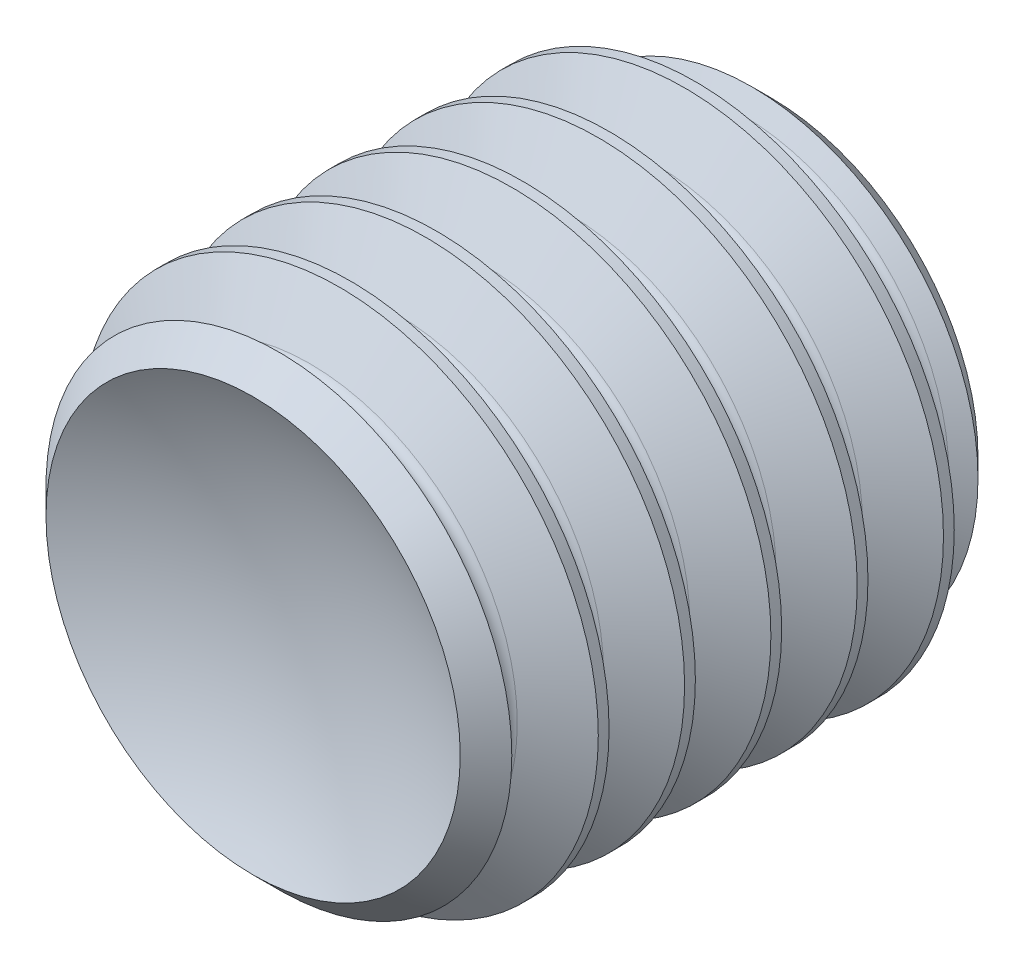
ISO-10303-21;
HEADER;
FILE_DESCRIPTION(('STEP AP214'),'2;1');
FILE_NAME('part.step','',(''),(''),'','','');
FILE_SCHEMA(('AUTOMOTIVE_DESIGN { 1 0 10303 214 1 1 1 1 }'));
ENDSEC;
DATA;
#1=APPLICATION_CONTEXT('core data for automotive mechanical design processes');
#2=APPLICATION_PROTOCOL_DEFINITION('international standard','automotive_design',2000,#1);
#3=PRODUCT_CONTEXT('',#1,'mechanical');
#4=PRODUCT('Part','Part','',(#3));
#5=PRODUCT_RELATED_PRODUCT_CATEGORY('part','',(#4));
#6=PRODUCT_DEFINITION_FORMATION('','',#4);
#7=PRODUCT_DEFINITION_CONTEXT('part definition',#1,'design');
#8=PRODUCT_DEFINITION('design','',#6,#7);
#9=PRODUCT_DEFINITION_SHAPE('','',#8);
#10=(LENGTH_UNIT() NAMED_UNIT(*) SI_UNIT(.MILLI.,.METRE.));
#11=(NAMED_UNIT(*) PLANE_ANGLE_UNIT() SI_UNIT($,.RADIAN.));
#12=(NAMED_UNIT(*) SI_UNIT($,.STERADIAN.) SOLID_ANGLE_UNIT());
#13=UNCERTAINTY_MEASURE_WITH_UNIT(LENGTH_MEASURE(1.E-05),#10,'distance_accuracy_value','');
#14=(GEOMETRIC_REPRESENTATION_CONTEXT(3) GLOBAL_UNCERTAINTY_ASSIGNED_CONTEXT((#13)) GLOBAL_UNIT_ASSIGNED_CONTEXT((#10,
#11,#12)) REPRESENTATION_CONTEXT('',''));
#15=CARTESIAN_POINT('',(0.,0.,0.));
#16=DIRECTION('',(0.,0.,1.));
#17=DIRECTION('',(1.,0.,0.));
#18=AXIS2_PLACEMENT_3D('',#15,#16,#17);
#19=CARTESIAN_POINT('',(0.,1.5,0.));
#20=DIRECTION('',(0.,0.,1.));
#21=DIRECTION('',(0.,-1.,0.));
#22=AXIS2_PLACEMENT_3D('',#19,#20,#21);
#23=PLANE('',#22);
#24=CARTESIAN_POINT('',(0.,0.,0.));
#25=DIRECTION('',(0.,0.,1.));
#26=DIRECTION('',(1.,0.,0.));
#27=AXIS2_PLACEMENT_3D('',#24,#25,#26);
#28=CIRCLE('',#27,1.2);
#29=CARTESIAN_POINT('',(1.2,0.,0.));
#30=VERTEX_POINT('',#29);
#31=EDGE_CURVE('E11',#30,#30,#28,.T.);
#32=ORIENTED_EDGE('',*,*,#31,.F.);
#33=EDGE_LOOP('',(#32));
#34=FACE_BOUND('',#33,.T.);
#35=DIRECTION('',(-0.5,0.866025403784439,0.));
#36=VECTOR('',#35,1.);
#37=CARTESIAN_POINT('',(0.866025403784439,0.,0.));
#38=LINE('',#37,#36);
#39=CARTESIAN_POINT('',(0.866025403784439,0.,0.));
#40=VERTEX_POINT('',#39);
#41=CARTESIAN_POINT('',(0.433012701892219,0.75,0.));
#42=VERTEX_POINT('',#41);
#43=EDGE_CURVE('E51',#40,#42,#38,.T.);
#44=ORIENTED_EDGE('',*,*,#43,.T.);
#45=DIRECTION('',(-1.,0.,0.));
#46=VECTOR('',#45,1.);
#47=CARTESIAN_POINT('',(0.433012701892219,0.75,0.));
#48=LINE('',#47,#46);
#49=CARTESIAN_POINT('',(-0.433012701892219,0.75,0.));
#50=VERTEX_POINT('',#49);
#51=EDGE_CURVE('E128',#42,#50,#48,.T.);
#52=ORIENTED_EDGE('',*,*,#51,.T.);
#53=DIRECTION('',(-0.5,-0.866025403784439,0.));
#54=VECTOR('',#53,1.);
#55=CARTESIAN_POINT('',(-0.433012701892219,0.75,0.));
#56=LINE('',#55,#54);
#57=CARTESIAN_POINT('',(-0.866025403784439,0.,0.));
#58=VERTEX_POINT('',#57);
#59=EDGE_CURVE('E131',#50,#58,#56,.T.);
#60=ORIENTED_EDGE('',*,*,#59,.T.);
#61=DIRECTION('',(0.5,-0.866025403784439,0.));
#62=VECTOR('',#61,1.);
#63=CARTESIAN_POINT('',(-0.866025403784439,0.,0.));
#64=LINE('',#63,#62);
#65=CARTESIAN_POINT('',(-0.433012701892219,-0.75,0.));
#66=VERTEX_POINT('',#65);
#67=EDGE_CURVE('E134',#58,#66,#64,.T.);
#68=ORIENTED_EDGE('',*,*,#67,.T.);
#69=DIRECTION('',(1.,0.,0.));
#70=VECTOR('',#69,1.);
#71=CARTESIAN_POINT('',(-0.433012701892219,-0.75,0.));
#72=LINE('',#71,#70);
#73=CARTESIAN_POINT('',(0.43301270189222,-0.75,0.));
#74=VERTEX_POINT('',#73);
#75=EDGE_CURVE('E98',#66,#74,#72,.T.);
#76=ORIENTED_EDGE('',*,*,#75,.T.);
#77=DIRECTION('',(0.5,0.866025403784439,0.));
#78=VECTOR('',#77,1.);
#79=CARTESIAN_POINT('',(0.43301270189222,-0.75,0.));
#80=LINE('',#79,#78);
#81=EDGE_CURVE('E93',#74,#40,#80,.T.);
#82=ORIENTED_EDGE('',*,*,#81,.T.);
#83=EDGE_LOOP('',(#44,#52,#60,#68,#76,#82));
#84=FACE_BOUND('',#83,.T.);
#85=ADVANCED_FACE('F34',(#34,#84),#23,.F.);
#86=CARTESIAN_POINT('',(0.,0.,3.));
#87=DIRECTION('',(0.,0.,1.));
#88=DIRECTION('',(0.,-1.,0.));
#89=AXIS2_PLACEMENT_3D('',#86,#87,#88);
#90=CYLINDRICAL_SURFACE('',#89,1.5);
#91=CARTESIAN_POINT('',(0.,0.,0.5));
#92=DIRECTION('',(0.,0.,1.));
#93=DIRECTION('',(1.,0.,0.));
#94=AXIS2_PLACEMENT_3D('',#91,#92,#93);
#95=CIRCLE('',#94,1.5);
#96=CARTESIAN_POINT('',(1.5,0.,0.5));
#97=VERTEX_POINT('',#96);
#98=EDGE_CURVE('E185',#97,#97,#95,.T.);
#99=ORIENTED_EDGE('',*,*,#98,.F.);
#100=EDGE_LOOP('',(#99));
#101=FACE_BOUND('',#100,.T.);
#102=CARTESIAN_POINT('',(0.,0.,0.437499999999999));
#103=DIRECTION('',(0.,0.,1.));
#104=DIRECTION('',(1.,0.,0.));
#105=AXIS2_PLACEMENT_3D('',#102,#103,#104);
#106=CIRCLE('',#105,1.5);
#107=CARTESIAN_POINT('',(1.5,0.,0.437499999999999));
#108=VERTEX_POINT('',#107);
#109=EDGE_CURVE('E197',#108,#108,#106,.T.);
#110=ORIENTED_EDGE('',*,*,#109,.T.);
#111=EDGE_LOOP('',(#110));
#112=FACE_BOUND('',#111,.T.);
#113=ADVANCED_FACE('F36',(#101,#112),#90,.T.);
#114=CARTESIAN_POINT('',(0.,0.,0.));
#115=DIRECTION('',(0.,0.,-1.));
#116=DIRECTION('',(-1.,0.,0.));
#117=AXIS2_PLACEMENT_3D('',#114,#115,#116);
#118=CONICAL_SURFACE('',#117,1.5,1.0471975511966);
#119=CARTESIAN_POINT('',(0.,0.,0.171875));
#120=DIRECTION('',(0.,0.,1.));
#121=DIRECTION('',(1.,0.,0.));
#122=AXIS2_PLACEMENT_3D('',#119,#120,#121);
#123=CIRCLE('',#122,1.2023037674491);
#124=CARTESIAN_POINT('',(1.2023037674491,0.,0.171875));
#125=VERTEX_POINT('',#124);
#126=EDGE_CURVE('E194',#125,#125,#123,.T.);
#127=ORIENTED_EDGE('',*,*,#126,.F.);
#128=EDGE_LOOP('',(#127));
#129=FACE_BOUND('',#128,.T.);
#130=CARTESIAN_POINT('',(0.,0.,0.109807621135333));
#131=DIRECTION('',(0.,0.,-1.));
#132=DIRECTION('',(-1.,0.,0.));
#133=AXIS2_PLACEMENT_3D('',#130,#131,#132);
#134=CIRCLE('',#133,1.30980762113533);
#135=CARTESIAN_POINT('',(-1.30980762113533,0.,0.109807621135333));
#136=VERTEX_POINT('',#135);
#137=EDGE_CURVE('E43',#136,#136,#134,.T.);
#138=ORIENTED_EDGE('',*,*,#137,.F.);
#139=EDGE_LOOP('',(#138));
#140=FACE_BOUND('',#139,.T.);
#141=ADVANCED_FACE('F205',(#129,#140),#118,.T.);
#142=CARTESIAN_POINT('',(0.,0.,0.265624999999999));
#143=DIRECTION('',(0.,0.,1.));
#144=DIRECTION('',(1.,0.,0.));
#145=AXIS2_PLACEMENT_3D('',#142,#143,#144);
#146=CONICAL_SURFACE('',#145,1.2023037674491,1.0471975511966);
#147=ORIENTED_EDGE('',*,*,#109,.F.);
#148=EDGE_LOOP('',(#147));
#149=FACE_BOUND('',#148,.T.);
#150=CARTESIAN_POINT('',(0.,0.,0.265624999999999));
#151=DIRECTION('',(0.,0.,1.));
#152=DIRECTION('',(1.,0.,0.));
#153=AXIS2_PLACEMENT_3D('',#150,#151,#152);
#154=CIRCLE('',#153,1.2023037674491);
#155=CARTESIAN_POINT('',(1.2023037674491,0.,0.265624999999999));
#156=VERTEX_POINT('',#155);
#157=EDGE_CURVE('E191',#156,#156,#154,.T.);
#158=ORIENTED_EDGE('',*,*,#157,.T.);
#159=EDGE_LOOP('',(#158));
#160=FACE_BOUND('',#159,.T.);
#161=ADVANCED_FACE('F207',(#149,#160),#146,.T.);
#162=CARTESIAN_POINT('',(0.,0.,0.21875));
#163=DIRECTION('',(0.,0.,1.));
#164=DIRECTION('',(1.,0.,0.));
#165=AXIS2_PLACEMENT_3D('',#162,#163,#164);
#166=TOROIDAL_SURFACE('',#165,1.22936706131736,0.0541265877365271);
#167=ORIENTED_EDGE('',*,*,#157,.F.);
#168=EDGE_LOOP('',(#167));
#169=FACE_BOUND('',#168,.T.);
#170=ORIENTED_EDGE('',*,*,#126,.T.);
#171=EDGE_LOOP('',(#170));
#172=FACE_BOUND('',#171,.T.);
#173=ADVANCED_FACE('F214',(#169,#172),#166,.F.);
#174=CARTESIAN_POINT('',(0.,0.,0.));
#175=DIRECTION('',(0.,0.,1.));
#176=DIRECTION('',(1.,0.,0.));
#177=AXIS2_PLACEMENT_3D('',#174,#175,#176);
#178=CONICAL_SURFACE('',#177,1.2,0.785398163397443);
#179=ORIENTED_EDGE('',*,*,#137,.T.);
#180=EDGE_LOOP('',(#179));
#181=FACE_BOUND('',#180,.T.);
#182=ORIENTED_EDGE('',*,*,#31,.T.);
#183=EDGE_LOOP('',(#182));
#184=FACE_BOUND('',#183,.T.);
#185=ADVANCED_FACE('F202',(#181,#184),#178,.T.);
#186=CARTESIAN_POINT('',(0.,0.,0.765624999999999));
#187=DIRECTION('',(0.,0.,1.));
#188=DIRECTION('',(1.,0.,0.));
#189=AXIS2_PLACEMENT_3D('',#186,#187,#188);
#190=CONICAL_SURFACE('',#189,1.2023037674491,1.0471975511966);
#191=CARTESIAN_POINT('',(0.,0.,0.937499999999999));
#192=DIRECTION('',(0.,0.,1.));
#193=DIRECTION('',(1.,0.,0.));
#194=AXIS2_PLACEMENT_3D('',#191,#192,#193);
#195=CIRCLE('',#194,1.5);
#196=CARTESIAN_POINT('',(1.5,0.,0.937499999999999));
#197=VERTEX_POINT('',#196);
#198=EDGE_CURVE('E188',#197,#197,#195,.T.);
#199=ORIENTED_EDGE('',*,*,#198,.F.);
#200=EDGE_LOOP('',(#199));
#201=FACE_BOUND('',#200,.T.);
#202=CARTESIAN_POINT('',(0.,0.,0.765624999999999));
#203=DIRECTION('',(0.,0.,1.));
#204=DIRECTION('',(1.,0.,0.));
#205=AXIS2_PLACEMENT_3D('',#202,#203,#204);
#206=CIRCLE('',#205,1.2023037674491);
#207=CARTESIAN_POINT('',(1.2023037674491,0.,0.765624999999999));
#208=VERTEX_POINT('',#207);
#209=EDGE_CURVE('E179',#208,#208,#206,.T.);
#210=ORIENTED_EDGE('',*,*,#209,.T.);
#211=EDGE_LOOP('',(#210));
#212=FACE_BOUND('',#211,.T.);
#213=ADVANCED_FACE('F236',(#201,#212),#190,.T.);
#214=CARTESIAN_POINT('',(0.,0.,0.5));
#215=DIRECTION('',(0.,0.,-1.));
#216=DIRECTION('',(-1.,0.,0.));
#217=AXIS2_PLACEMENT_3D('',#214,#215,#216);
#218=CONICAL_SURFACE('',#217,1.5,1.0471975511966);
#219=CARTESIAN_POINT('',(0.,0.,0.671875));
#220=DIRECTION('',(0.,0.,1.));
#221=DIRECTION('',(1.,0.,0.));
#222=AXIS2_PLACEMENT_3D('',#219,#220,#221);
#223=CIRCLE('',#222,1.2023037674491);
#224=CARTESIAN_POINT('',(1.2023037674491,0.,0.671875));
#225=VERTEX_POINT('',#224);
#226=EDGE_CURVE('E182',#225,#225,#223,.T.);
#227=ORIENTED_EDGE('',*,*,#226,.F.);
#228=EDGE_LOOP('',(#227));
#229=FACE_BOUND('',#228,.T.);
#230=ORIENTED_EDGE('',*,*,#98,.T.);
#231=EDGE_LOOP('',(#230));
#232=FACE_BOUND('',#231,.T.);
#233=ADVANCED_FACE('F241',(#229,#232),#218,.T.);
#234=CARTESIAN_POINT('',(0.,0.,0.71875));
#235=DIRECTION('',(0.,0.,1.));
#236=DIRECTION('',(1.,0.,0.));
#237=AXIS2_PLACEMENT_3D('',#234,#235,#236);
#238=TOROIDAL_SURFACE('',#237,1.22936706131736,0.0541265877365271);
#239=ORIENTED_EDGE('',*,*,#209,.F.);
#240=EDGE_LOOP('',(#239));
#241=FACE_BOUND('',#240,.T.);
#242=ORIENTED_EDGE('',*,*,#226,.T.);
#243=EDGE_LOOP('',(#242));
#244=FACE_BOUND('',#243,.T.);
#245=ADVANCED_FACE('F252',(#241,#244),#238,.F.);
#246=CARTESIAN_POINT('',(0.,0.,1.));
#247=DIRECTION('',(0.,0.,1.));
#248=DIRECTION('',(1.,0.,0.));
#249=AXIS2_PLACEMENT_3D('',#246,#247,#248);
#250=CIRCLE('',#249,1.5);
#251=CARTESIAN_POINT('',(1.5,0.,1.));
#252=VERTEX_POINT('',#251);
#253=EDGE_CURVE('E173',#252,#252,#250,.T.);
#254=ORIENTED_EDGE('',*,*,#253,.F.);
#255=EDGE_LOOP('',(#254));
#256=FACE_BOUND('',#255,.T.);
#257=ORIENTED_EDGE('',*,*,#198,.T.);
#258=EDGE_LOOP('',(#257));
#259=FACE_BOUND('',#258,.T.);
#260=ADVANCED_FACE('F219',(#256,#259),#90,.T.);
#261=CARTESIAN_POINT('',(0.,0.,1.265625));
#262=DIRECTION('',(0.,0.,1.));
#263=DIRECTION('',(1.,0.,0.));
#264=AXIS2_PLACEMENT_3D('',#261,#262,#263);
#265=CONICAL_SURFACE('',#264,1.2023037674491,1.0471975511966);
#266=CARTESIAN_POINT('',(0.,0.,1.4375));
#267=DIRECTION('',(0.,0.,1.));
#268=DIRECTION('',(1.,0.,0.));
#269=AXIS2_PLACEMENT_3D('',#266,#267,#268);
#270=CIRCLE('',#269,1.5);
#271=CARTESIAN_POINT('',(1.5,0.,1.4375));
#272=VERTEX_POINT('',#271);
#273=EDGE_CURVE('E176',#272,#272,#270,.T.);
#274=ORIENTED_EDGE('',*,*,#273,.F.);
#275=EDGE_LOOP('',(#274));
#276=FACE_BOUND('',#275,.T.);
#277=CARTESIAN_POINT('',(0.,0.,1.265625));
#278=DIRECTION('',(0.,0.,1.));
#279=DIRECTION('',(1.,0.,0.));
#280=AXIS2_PLACEMENT_3D('',#277,#278,#279);
#281=CIRCLE('',#280,1.2023037674491);
#282=CARTESIAN_POINT('',(1.2023037674491,0.,1.265625));
#283=VERTEX_POINT('',#282);
#284=EDGE_CURVE('E167',#283,#283,#281,.T.);
#285=ORIENTED_EDGE('',*,*,#284,.T.);
#286=EDGE_LOOP('',(#285));
#287=FACE_BOUND('',#286,.T.);
#288=ADVANCED_FACE('F257',(#276,#287),#265,.T.);
#289=CARTESIAN_POINT('',(0.,0.,1.));
#290=DIRECTION('',(0.,0.,-1.));
#291=DIRECTION('',(-1.,0.,0.));
#292=AXIS2_PLACEMENT_3D('',#289,#290,#291);
#293=CONICAL_SURFACE('',#292,1.5,1.0471975511966);
#294=CARTESIAN_POINT('',(0.,0.,1.171875));
#295=DIRECTION('',(0.,0.,1.));
#296=DIRECTION('',(1.,0.,0.));
#297=AXIS2_PLACEMENT_3D('',#294,#295,#296);
#298=CIRCLE('',#297,1.2023037674491);
#299=CARTESIAN_POINT('',(1.2023037674491,0.,1.171875));
#300=VERTEX_POINT('',#299);
#301=EDGE_CURVE('E170',#300,#300,#298,.T.);
#302=ORIENTED_EDGE('',*,*,#301,.F.);
#303=EDGE_LOOP('',(#302));
#304=FACE_BOUND('',#303,.T.);
#305=ORIENTED_EDGE('',*,*,#253,.T.);
#306=EDGE_LOOP('',(#305));
#307=FACE_BOUND('',#306,.T.);
#308=ADVANCED_FACE('F260',(#304,#307),#293,.T.);
#309=CARTESIAN_POINT('',(0.,0.,1.21875));
#310=DIRECTION('',(0.,0.,1.));
#311=DIRECTION('',(1.,0.,0.));
#312=AXIS2_PLACEMENT_3D('',#309,#310,#311);
#313=TOROIDAL_SURFACE('',#312,1.22936706131736,0.0541265877365271);
#314=ORIENTED_EDGE('',*,*,#284,.F.);
#315=EDGE_LOOP('',(#314));
#316=FACE_BOUND('',#315,.T.);
#317=ORIENTED_EDGE('',*,*,#301,.T.);
#318=EDGE_LOOP('',(#317));
#319=FACE_BOUND('',#318,.T.);
#320=ADVANCED_FACE('F264',(#316,#319),#313,.F.);
#321=CARTESIAN_POINT('',(0.,0.,1.5));
#322=DIRECTION('',(0.,0.,1.));
#323=DIRECTION('',(1.,0.,0.));
#324=AXIS2_PLACEMENT_3D('',#321,#322,#323);
#325=CIRCLE('',#324,1.5);
#326=CARTESIAN_POINT('',(1.5,0.,1.5));
#327=VERTEX_POINT('',#326);
#328=EDGE_CURVE('E161',#327,#327,#325,.T.);
#329=ORIENTED_EDGE('',*,*,#328,.F.);
#330=EDGE_LOOP('',(#329));
#331=FACE_BOUND('',#330,.T.);
#332=ORIENTED_EDGE('',*,*,#273,.T.);
#333=EDGE_LOOP('',(#332));
#334=FACE_BOUND('',#333,.T.);
#335=ADVANCED_FACE('F268',(#331,#334),#90,.T.);
#336=CARTESIAN_POINT('',(0.,0.,1.765625));
#337=DIRECTION('',(0.,0.,1.));
#338=DIRECTION('',(1.,0.,0.));
#339=AXIS2_PLACEMENT_3D('',#336,#337,#338);
#340=CONICAL_SURFACE('',#339,1.2023037674491,1.0471975511966);
#341=CARTESIAN_POINT('',(0.,0.,1.9375));
#342=DIRECTION('',(0.,0.,1.));
#343=DIRECTION('',(1.,0.,0.));
#344=AXIS2_PLACEMENT_3D('',#341,#342,#343);
#345=CIRCLE('',#344,1.5);
#346=CARTESIAN_POINT('',(1.5,0.,1.9375));
#347=VERTEX_POINT('',#346);
#348=EDGE_CURVE('E164',#347,#347,#345,.T.);
#349=ORIENTED_EDGE('',*,*,#348,.F.);
#350=EDGE_LOOP('',(#349));
#351=FACE_BOUND('',#350,.T.);
#352=CARTESIAN_POINT('',(0.,0.,1.765625));
#353=DIRECTION('',(0.,0.,1.));
#354=DIRECTION('',(1.,0.,0.));
#355=AXIS2_PLACEMENT_3D('',#352,#353,#354);
#356=CIRCLE('',#355,1.2023037674491);
#357=CARTESIAN_POINT('',(1.2023037674491,0.,1.765625));
#358=VERTEX_POINT('',#357);
#359=EDGE_CURVE('E155',#358,#358,#356,.T.);
#360=ORIENTED_EDGE('',*,*,#359,.T.);
#361=EDGE_LOOP('',(#360));
#362=FACE_BOUND('',#361,.T.);
#363=ADVANCED_FACE('F270',(#351,#362),#340,.T.);
#364=CARTESIAN_POINT('',(0.,0.,1.5));
#365=DIRECTION('',(0.,0.,-1.));
#366=DIRECTION('',(-1.,0.,0.));
#367=AXIS2_PLACEMENT_3D('',#364,#365,#366);
#368=CONICAL_SURFACE('',#367,1.5,1.0471975511966);
#369=CARTESIAN_POINT('',(0.,0.,1.671875));
#370=DIRECTION('',(0.,0.,1.));
#371=DIRECTION('',(1.,0.,0.));
#372=AXIS2_PLACEMENT_3D('',#369,#370,#371);
#373=CIRCLE('',#372,1.2023037674491);
#374=CARTESIAN_POINT('',(1.2023037674491,0.,1.671875));
#375=VERTEX_POINT('',#374);
#376=EDGE_CURVE('E158',#375,#375,#373,.T.);
#377=ORIENTED_EDGE('',*,*,#376,.F.);
#378=EDGE_LOOP('',(#377));
#379=FACE_BOUND('',#378,.T.);
#380=ORIENTED_EDGE('',*,*,#328,.T.);
#381=EDGE_LOOP('',(#380));
#382=FACE_BOUND('',#381,.T.);
#383=ADVANCED_FACE('F273',(#379,#382),#368,.T.);
#384=CARTESIAN_POINT('',(0.,0.,1.71875));
#385=DIRECTION('',(0.,0.,1.));
#386=DIRECTION('',(1.,0.,0.));
#387=AXIS2_PLACEMENT_3D('',#384,#385,#386);
#388=TOROIDAL_SURFACE('',#387,1.22936706131736,0.0541265877365271);
#389=ORIENTED_EDGE('',*,*,#359,.F.);
#390=EDGE_LOOP('',(#389));
#391=FACE_BOUND('',#390,.T.);
#392=ORIENTED_EDGE('',*,*,#376,.T.);
#393=EDGE_LOOP('',(#392));
#394=FACE_BOUND('',#393,.T.);
#395=ADVANCED_FACE('F277',(#391,#394),#388,.F.);
#396=CARTESIAN_POINT('',(0.,0.,2.));
#397=DIRECTION('',(0.,0.,1.));
#398=DIRECTION('',(1.,0.,0.));
#399=AXIS2_PLACEMENT_3D('',#396,#397,#398);
#400=CIRCLE('',#399,1.5);
#401=CARTESIAN_POINT('',(1.5,0.,2.));
#402=VERTEX_POINT('',#401);
#403=EDGE_CURVE('E149',#402,#402,#400,.T.);
#404=ORIENTED_EDGE('',*,*,#403,.F.);
#405=EDGE_LOOP('',(#404));
#406=FACE_BOUND('',#405,.T.);
#407=ORIENTED_EDGE('',*,*,#348,.T.);
#408=EDGE_LOOP('',(#407));
#409=FACE_BOUND('',#408,.T.);
#410=ADVANCED_FACE('F281',(#406,#409),#90,.T.);
#411=CARTESIAN_POINT('',(0.,0.,2.265625));
#412=DIRECTION('',(0.,0.,1.));
#413=DIRECTION('',(1.,0.,0.));
#414=AXIS2_PLACEMENT_3D('',#411,#412,#413);
#415=CONICAL_SURFACE('',#414,1.2023037674491,1.0471975511966);
#416=CARTESIAN_POINT('',(0.,0.,2.4375));
#417=DIRECTION('',(0.,0.,1.));
#418=DIRECTION('',(1.,0.,0.));
#419=AXIS2_PLACEMENT_3D('',#416,#417,#418);
#420=CIRCLE('',#419,1.5);
#421=CARTESIAN_POINT('',(1.5,0.,2.4375));
#422=VERTEX_POINT('',#421);
#423=EDGE_CURVE('E152',#422,#422,#420,.T.);
#424=ORIENTED_EDGE('',*,*,#423,.F.);
#425=EDGE_LOOP('',(#424));
#426=FACE_BOUND('',#425,.T.);
#427=CARTESIAN_POINT('',(0.,0.,2.265625));
#428=DIRECTION('',(0.,0.,1.));
#429=DIRECTION('',(1.,0.,0.));
#430=AXIS2_PLACEMENT_3D('',#427,#428,#429);
#431=CIRCLE('',#430,1.2023037674491);
#432=CARTESIAN_POINT('',(1.2023037674491,0.,2.265625));
#433=VERTEX_POINT('',#432);
#434=EDGE_CURVE('E143',#433,#433,#431,.T.);
#435=ORIENTED_EDGE('',*,*,#434,.T.);
#436=EDGE_LOOP('',(#435));
#437=FACE_BOUND('',#436,.T.);
#438=ADVANCED_FACE('F283',(#426,#437),#415,.T.);
#439=CARTESIAN_POINT('',(0.,0.,2.));
#440=DIRECTION('',(0.,0.,-1.));
#441=DIRECTION('',(-1.,0.,0.));
#442=AXIS2_PLACEMENT_3D('',#439,#440,#441);
#443=CONICAL_SURFACE('',#442,1.5,1.0471975511966);
#444=CARTESIAN_POINT('',(0.,0.,2.171875));
#445=DIRECTION('',(0.,0.,1.));
#446=DIRECTION('',(1.,0.,0.));
#447=AXIS2_PLACEMENT_3D('',#444,#445,#446);
#448=CIRCLE('',#447,1.2023037674491);
#449=CARTESIAN_POINT('',(1.2023037674491,0.,2.171875));
#450=VERTEX_POINT('',#449);
#451=EDGE_CURVE('E146',#450,#450,#448,.T.);
#452=ORIENTED_EDGE('',*,*,#451,.F.);
#453=EDGE_LOOP('',(#452));
#454=FACE_BOUND('',#453,.T.);
#455=ORIENTED_EDGE('',*,*,#403,.T.);
#456=EDGE_LOOP('',(#455));
#457=FACE_BOUND('',#456,.T.);
#458=ADVANCED_FACE('F286',(#454,#457),#443,.T.);
#459=CARTESIAN_POINT('',(0.,0.,2.21875));
#460=DIRECTION('',(0.,0.,1.));
#461=DIRECTION('',(1.,0.,0.));
#462=AXIS2_PLACEMENT_3D('',#459,#460,#461);
#463=TOROIDAL_SURFACE('',#462,1.22936706131736,0.0541265877365271);
#464=ORIENTED_EDGE('',*,*,#434,.F.);
#465=EDGE_LOOP('',(#464));
#466=FACE_BOUND('',#465,.T.);
#467=ORIENTED_EDGE('',*,*,#451,.T.);
#468=EDGE_LOOP('',(#467));
#469=FACE_BOUND('',#468,.T.);
#470=ADVANCED_FACE('F290',(#466,#469),#463,.F.);
#471=CARTESIAN_POINT('',(0.,0.,2.5));
#472=DIRECTION('',(0.,0.,1.));
#473=DIRECTION('',(1.,0.,0.));
#474=AXIS2_PLACEMENT_3D('',#471,#472,#473);
#475=CIRCLE('',#474,1.5);
#476=CARTESIAN_POINT('',(1.5,0.,2.5));
#477=VERTEX_POINT('',#476);
#478=EDGE_CURVE('E140',#477,#477,#475,.T.);
#479=ORIENTED_EDGE('',*,*,#478,.F.);
#480=EDGE_LOOP('',(#479));
#481=FACE_BOUND('',#480,.T.);
#482=ORIENTED_EDGE('',*,*,#423,.T.);
#483=EDGE_LOOP('',(#482));
#484=FACE_BOUND('',#483,.T.);
#485=ADVANCED_FACE('F218',(#481,#484),#90,.T.);
#486=CARTESIAN_POINT('',(0.,0.,2.765625));
#487=DIRECTION('',(0.,0.,1.));
#488=DIRECTION('',(1.,0.,0.));
#489=AXIS2_PLACEMENT_3D('',#486,#487,#488);
#490=CONICAL_SURFACE('',#489,1.2023037674491,1.0471975511966);
#491=CARTESIAN_POINT('',(0.,0.,2.765625));
#492=DIRECTION('',(0.,0.,1.));
#493=DIRECTION('',(1.,0.,0.));
#494=AXIS2_PLACEMENT_3D('',#491,#492,#493);
#495=CIRCLE('',#494,1.2023037674491);
#496=CARTESIAN_POINT('',(1.2023037674491,0.,2.765625));
#497=VERTEX_POINT('',#496);
#498=EDGE_CURVE('E109',#497,#497,#495,.T.);
#499=ORIENTED_EDGE('',*,*,#498,.T.);
#500=EDGE_LOOP('',(#499));
#501=FACE_BOUND('',#500,.T.);
#502=CARTESIAN_POINT('',(0.,0.,2.85056896660119));
#503=DIRECTION('',(0.,0.,1.));
#504=DIRECTION('',(1.,0.,0.));
#505=AXIS2_PLACEMENT_3D('',#502,#503,#504);
#506=CIRCLE('',#505,1.3494310333988);
#507=CARTESIAN_POINT('',(1.3494310333988,0.,2.85056896660119));
#508=VERTEX_POINT('',#507);
#509=EDGE_CURVE('E38',#508,#508,#506,.T.);
#510=ORIENTED_EDGE('',*,*,#509,.F.);
#511=EDGE_LOOP('',(#510));
#512=FACE_BOUND('',#511,.T.);
#513=ADVANCED_FACE('F295',(#501,#512),#490,.T.);
#514=CARTESIAN_POINT('',(0.,0.,2.5));
#515=DIRECTION('',(0.,0.,-1.));
#516=DIRECTION('',(-1.,0.,0.));
#517=AXIS2_PLACEMENT_3D('',#514,#515,#516);
#518=CONICAL_SURFACE('',#517,1.5,1.0471975511966);
#519=CARTESIAN_POINT('',(0.,0.,2.671875));
#520=DIRECTION('',(0.,0.,1.));
#521=DIRECTION('',(1.,0.,0.));
#522=AXIS2_PLACEMENT_3D('',#519,#520,#521);
#523=CIRCLE('',#522,1.2023037674491);
#524=CARTESIAN_POINT('',(1.2023037674491,0.,2.671875));
#525=VERTEX_POINT('',#524);
#526=EDGE_CURVE('E113',#525,#525,#523,.T.);
#527=ORIENTED_EDGE('',*,*,#526,.F.);
#528=EDGE_LOOP('',(#527));
#529=FACE_BOUND('',#528,.T.);
#530=ORIENTED_EDGE('',*,*,#478,.T.);
#531=EDGE_LOOP('',(#530));
#532=FACE_BOUND('',#531,.T.);
#533=ADVANCED_FACE('F298',(#529,#532),#518,.T.);
#534=CARTESIAN_POINT('',(0.,0.,2.71875));
#535=DIRECTION('',(0.,0.,1.));
#536=DIRECTION('',(1.,0.,0.));
#537=AXIS2_PLACEMENT_3D('',#534,#535,#536);
#538=TOROIDAL_SURFACE('',#537,1.22936706131736,0.0541265877365271);
#539=ORIENTED_EDGE('',*,*,#498,.F.);
#540=EDGE_LOOP('',(#539));
#541=FACE_BOUND('',#540,.T.);
#542=ORIENTED_EDGE('',*,*,#526,.T.);
#543=EDGE_LOOP('',(#542));
#544=FACE_BOUND('',#543,.T.);
#545=ADVANCED_FACE('F233',(#541,#544),#538,.F.);
#546=CARTESIAN_POINT('',(0.,0.,2.7));
#547=DIRECTION('',(0.,0.,-1.));
#548=DIRECTION('',(-1.,0.,0.));
#549=AXIS2_PLACEMENT_3D('',#546,#547,#548);
#550=CONICAL_SURFACE('',#549,1.5,0.785398163397443);
#551=ORIENTED_EDGE('',*,*,#509,.T.);
#552=EDGE_LOOP('',(#551));
#553=FACE_BOUND('',#552,.T.);
#554=CARTESIAN_POINT('',(0.,0.,3.));
#555=DIRECTION('',(0.,0.,1.));
#556=DIRECTION('',(1.,0.,0.));
#557=AXIS2_PLACEMENT_3D('',#554,#555,#556);
#558=CIRCLE('',#557,1.2);
#559=CARTESIAN_POINT('',(1.2,0.,3.));
#560=VERTEX_POINT('',#559);
#561=EDGE_CURVE('E136',#560,#560,#558,.T.);
#562=ORIENTED_EDGE('',*,*,#561,.F.);
#563=EDGE_LOOP('',(#562));
#564=FACE_BOUND('',#563,.T.);
#565=ADVANCED_FACE('F229',(#553,#564),#550,.T.);
#566=CARTESIAN_POINT('',(0.866025403784439,0.,3.79128784747792));
#567=DIRECTION('',(-0.866025403784439,-0.5,0.));
#568=DIRECTION('',(0.5,-0.866025403784439,0.));
#569=AXIS2_PLACEMENT_3D('',#566,#567,#568);
#570=PLANE('',#569);
#571=DIRECTION('',(-0.5,0.866025403784439,0.));
#572=VECTOR('',#571,1.);
#573=CARTESIAN_POINT('',(0.866025403784439,0.,1.5));
#574=LINE('',#573,#572);
#575=CARTESIAN_POINT('',(0.866025403784439,0.,1.5));
#576=VERTEX_POINT('',#575);
#577=CARTESIAN_POINT('',(0.433012701892219,0.75,1.5));
#578=VERTEX_POINT('',#577);
#579=EDGE_CURVE('E104',#576,#578,#574,.T.);
#580=ORIENTED_EDGE('',*,*,#579,.T.);
#581=DIRECTION('',(0.,0.,-1.));
#582=VECTOR('',#581,1.);
#583=CARTESIAN_POINT('',(0.433012701892219,0.75,3.79128784747792));
#584=LINE('',#583,#582);
#585=EDGE_CURVE('E126',#578,#42,#584,.T.);
#586=ORIENTED_EDGE('',*,*,#585,.T.);
#587=ORIENTED_EDGE('',*,*,#43,.F.);
#588=DIRECTION('',(0.,0.,-1.));
#589=VECTOR('',#588,1.);
#590=CARTESIAN_POINT('',(0.866025403784439,0.,3.79128784747792));
#591=LINE('',#590,#589);
#592=EDGE_CURVE('E55',#576,#40,#591,.T.);
#593=ORIENTED_EDGE('',*,*,#592,.F.);
#594=EDGE_LOOP('',(#580,#586,#587,#593));
#595=FACE_BOUND('',#594,.T.);
#596=ADVANCED_FACE('F232',(#595),#570,.T.);
#597=CARTESIAN_POINT('',(0.433012701892219,0.75,3.79128784747792));
#598=DIRECTION('',(0.,-1.,0.));
#599=DIRECTION('',(1.,0.,0.));
#600=AXIS2_PLACEMENT_3D('',#597,#598,#599);
#601=PLANE('',#600);
#602=DIRECTION('',(-1.,0.,0.));
#603=VECTOR('',#602,1.);
#604=CARTESIAN_POINT('',(0.433012701892219,0.75,1.5));
#605=LINE('',#604,#603);
#606=CARTESIAN_POINT('',(-0.433012701892219,0.75,1.5));
#607=VERTEX_POINT('',#606);
#608=EDGE_CURVE('E122',#578,#607,#605,.T.);
#609=ORIENTED_EDGE('',*,*,#608,.T.);
#610=DIRECTION('',(0.,0.,-1.));
#611=VECTOR('',#610,1.);
#612=CARTESIAN_POINT('',(-0.433012701892219,0.75,3.79128784747792));
#613=LINE('',#612,#611);
#614=EDGE_CURVE('E129',#607,#50,#613,.T.);
#615=ORIENTED_EDGE('',*,*,#614,.T.);
#616=ORIENTED_EDGE('',*,*,#51,.F.);
#617=ORIENTED_EDGE('',*,*,#585,.F.);
#618=EDGE_LOOP('',(#609,#615,#616,#617));
#619=FACE_BOUND('',#618,.T.);
#620=ADVANCED_FACE('F311',(#619),#601,.T.);
#621=CARTESIAN_POINT('',(-0.433012701892219,0.75,3.79128784747792));
#622=DIRECTION('',(0.866025403784439,-0.5,0.));
#623=DIRECTION('',(0.5,0.866025403784439,0.));
#624=AXIS2_PLACEMENT_3D('',#621,#622,#623);
#625=PLANE('',#624);
#626=DIRECTION('',(-0.5,-0.866025403784439,0.));
#627=VECTOR('',#626,1.);
#628=CARTESIAN_POINT('',(-0.433012701892219,0.75,1.5));
#629=LINE('',#628,#627);
#630=CARTESIAN_POINT('',(-0.866025403784439,0.,1.5));
#631=VERTEX_POINT('',#630);
#632=EDGE_CURVE('E115',#607,#631,#629,.T.);
#633=ORIENTED_EDGE('',*,*,#632,.T.);
#634=DIRECTION('',(0.,0.,-1.));
#635=VECTOR('',#634,1.);
#636=CARTESIAN_POINT('',(-0.866025403784439,0.,3.79128784747792));
#637=LINE('',#636,#635);
#638=EDGE_CURVE('E132',#631,#58,#637,.T.);
#639=ORIENTED_EDGE('',*,*,#638,.T.);
#640=ORIENTED_EDGE('',*,*,#59,.F.);
#641=ORIENTED_EDGE('',*,*,#614,.F.);
#642=EDGE_LOOP('',(#633,#639,#640,#641));
#643=FACE_BOUND('',#642,.T.);
#644=ADVANCED_FACE('F314',(#643),#625,.T.);
#645=CARTESIAN_POINT('',(-0.866025403784439,0.,3.79128784747792));
#646=DIRECTION('',(0.866025403784439,0.5,0.));
#647=DIRECTION('',(-0.5,0.866025403784439,0.));
#648=AXIS2_PLACEMENT_3D('',#645,#646,#647);
#649=PLANE('',#648);
#650=DIRECTION('',(0.5,-0.866025403784439,0.));
#651=VECTOR('',#650,1.);
#652=CARTESIAN_POINT('',(-0.866025403784439,0.,1.5));
#653=LINE('',#652,#651);
#654=CARTESIAN_POINT('',(-0.433012701892219,-0.75,1.5));
#655=VERTEX_POINT('',#654);
#656=EDGE_CURVE('E110',#631,#655,#653,.T.);
#657=ORIENTED_EDGE('',*,*,#656,.T.);
#658=DIRECTION('',(0.,0.,-1.));
#659=VECTOR('',#658,1.);
#660=CARTESIAN_POINT('',(-0.433012701892219,-0.75,3.79128784747792));
#661=LINE('',#660,#659);
#662=EDGE_CURVE('E107',#655,#66,#661,.T.);
#663=ORIENTED_EDGE('',*,*,#662,.T.);
#664=ORIENTED_EDGE('',*,*,#67,.F.);
#665=ORIENTED_EDGE('',*,*,#638,.F.);
#666=EDGE_LOOP('',(#657,#663,#664,#665));
#667=FACE_BOUND('',#666,.T.);
#668=ADVANCED_FACE('F318',(#667),#649,.T.);
#669=CARTESIAN_POINT('',(-0.433012701892219,-0.75,3.79128784747792));
#670=DIRECTION('',(0.,1.,0.));
#671=DIRECTION('',(-1.,0.,0.));
#672=AXIS2_PLACEMENT_3D('',#669,#670,#671);
#673=PLANE('',#672);
#674=DIRECTION('',(1.,0.,0.));
#675=VECTOR('',#674,1.);
#676=CARTESIAN_POINT('',(-0.433012701892219,-0.75,1.5));
#677=LINE('',#676,#675);
#678=CARTESIAN_POINT('',(0.43301270189222,-0.75,1.5));
#679=VERTEX_POINT('',#678);
#680=EDGE_CURVE('E102',#655,#679,#677,.T.);
#681=ORIENTED_EDGE('',*,*,#680,.T.);
#682=DIRECTION('',(0.,0.,-1.));
#683=VECTOR('',#682,1.);
#684=CARTESIAN_POINT('',(0.43301270189222,-0.75,3.79128784747792));
#685=LINE('',#684,#683);
#686=EDGE_CURVE('E88',#679,#74,#685,.T.);
#687=ORIENTED_EDGE('',*,*,#686,.T.);
#688=ORIENTED_EDGE('',*,*,#75,.F.);
#689=ORIENTED_EDGE('',*,*,#662,.F.);
#690=EDGE_LOOP('',(#681,#687,#688,#689));
#691=FACE_BOUND('',#690,.T.);
#692=ADVANCED_FACE('F106',(#691),#673,.T.);
#693=CARTESIAN_POINT('',(0.43301270189222,-0.75,3.79128784747792));
#694=DIRECTION('',(-0.866025403784439,0.5,0.));
#695=DIRECTION('',(-0.5,-0.866025403784439,0.));
#696=AXIS2_PLACEMENT_3D('',#693,#694,#695);
#697=PLANE('',#696);
#698=DIRECTION('',(0.5,0.866025403784439,0.));
#699=VECTOR('',#698,1.);
#700=CARTESIAN_POINT('',(0.43301270189222,-0.75,1.5));
#701=LINE('',#700,#699);
#702=EDGE_CURVE('E91',#679,#576,#701,.T.);
#703=ORIENTED_EDGE('',*,*,#702,.T.);
#704=ORIENTED_EDGE('',*,*,#592,.T.);
#705=ORIENTED_EDGE('',*,*,#81,.F.);
#706=ORIENTED_EDGE('',*,*,#686,.F.);
#707=EDGE_LOOP('',(#703,#704,#705,#706));
#708=FACE_BOUND('',#707,.T.);
#709=ADVANCED_FACE('F90',(#708),#697,.T.);
#710=CARTESIAN_POINT('',(0.,0.,1.5));
#711=DIRECTION('',(0.,0.,1.));
#712=DIRECTION('',(1.,0.,0.));
#713=AXIS2_PLACEMENT_3D('',#710,#711,#712);
#714=PLANE('',#713);
#715=ORIENTED_EDGE('',*,*,#702,.F.);
#716=ORIENTED_EDGE('',*,*,#680,.F.);
#717=ORIENTED_EDGE('',*,*,#656,.F.);
#718=ORIENTED_EDGE('',*,*,#632,.F.);
#719=ORIENTED_EDGE('',*,*,#608,.F.);
#720=ORIENTED_EDGE('',*,*,#579,.F.);
#721=EDGE_LOOP('',(#715,#716,#717,#718,#719,#720));
#722=FACE_BOUND('',#721,.T.);
#723=ADVANCED_FACE('F101',(#722),#714,.F.);
#724=CARTESIAN_POINT('',(0.,0.,5.24999999999997));
#725=DIRECTION('',(0.,0.,1.));
#726=DIRECTION('',(0.,-1.,0.));
#727=AXIS2_PLACEMENT_3D('',#724,#725,#726);
#728=SPHERICAL_SURFACE('',#727,2.54999999999997);
#729=ORIENTED_EDGE('',*,*,#561,.T.);
#730=EDGE_LOOP('',(#729));
#731=FACE_BOUND('',#730,.T.);
#732=ADVANCED_FACE('F308',(#731),#728,.F.);
#733=CLOSED_SHELL('',(#85,#113,#141,#161,#173,#185,#213,#233,#245,#260,#288,#308,#320,#335,#363,
#383,#395,#410,#438,#458,#470,#485,#513,#533,#545,#565,#596,#620,#644,#668,#692,#709,#723,#732));
#734=MANIFOLD_SOLID_BREP('B2',#733);
#735=ADVANCED_BREP_SHAPE_REPRESENTATION('',(#18,#734),#14);
#736=SHAPE_DEFINITION_REPRESENTATION(#9,#735);
ENDSEC;
END-ISO-10303-21;
